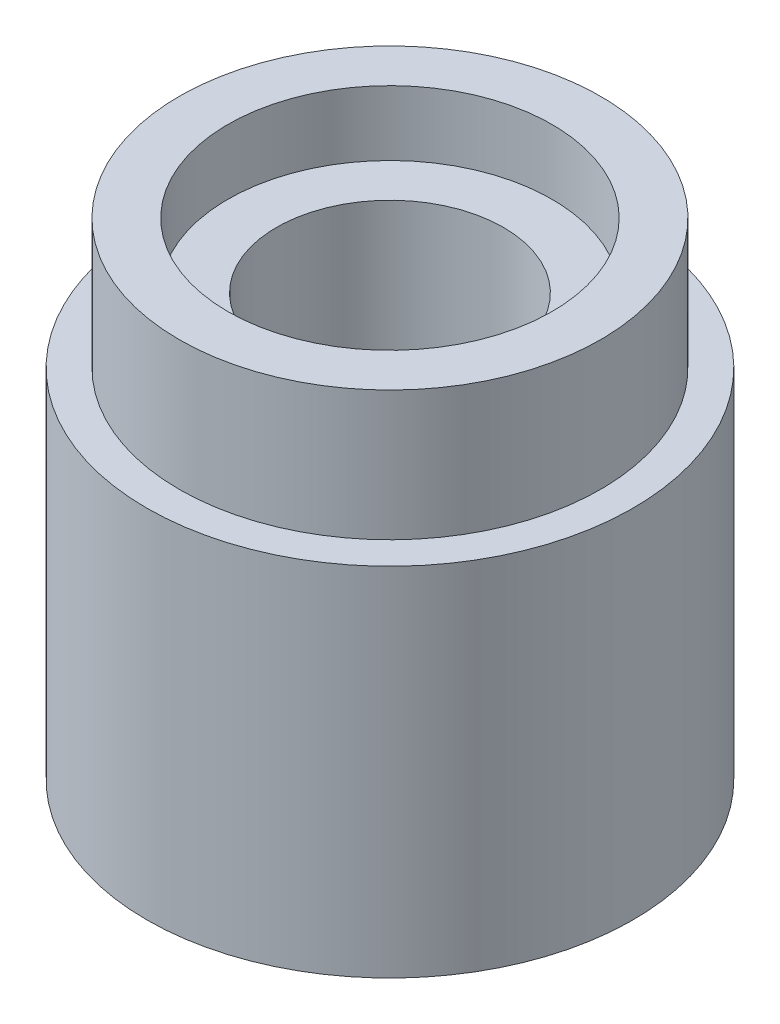
ISO-10303-21;
HEADER;
FILE_DESCRIPTION(('STEP AP214'),'2;1');
FILE_NAME('part.step','',(''),(''),'','','');
FILE_SCHEMA(('AUTOMOTIVE_DESIGN { 1 0 10303 214 1 1 1 1 }'));
ENDSEC;
DATA;
#1=APPLICATION_CONTEXT('core data for automotive mechanical design processes');
#2=APPLICATION_PROTOCOL_DEFINITION('international standard','automotive_design',2000,#1);
#3=PRODUCT_CONTEXT('',#1,'mechanical');
#4=PRODUCT('Part','Part','',(#3));
#5=PRODUCT_RELATED_PRODUCT_CATEGORY('part','',(#4));
#6=PRODUCT_DEFINITION_FORMATION('','',#4);
#7=PRODUCT_DEFINITION_CONTEXT('part definition',#1,'design');
#8=PRODUCT_DEFINITION('design','',#6,#7);
#9=PRODUCT_DEFINITION_SHAPE('','',#8);
#10=(LENGTH_UNIT() NAMED_UNIT(*) SI_UNIT(.MILLI.,.METRE.));
#11=(NAMED_UNIT(*) PLANE_ANGLE_UNIT() SI_UNIT($,.RADIAN.));
#12=(NAMED_UNIT(*) SI_UNIT($,.STERADIAN.) SOLID_ANGLE_UNIT());
#13=UNCERTAINTY_MEASURE_WITH_UNIT(LENGTH_MEASURE(1.E-05),#10,'distance_accuracy_value','');
#14=(GEOMETRIC_REPRESENTATION_CONTEXT(3) GLOBAL_UNCERTAINTY_ASSIGNED_CONTEXT((#13)) GLOBAL_UNIT_ASSIGNED_CONTEXT((#10,
#11,#12)) REPRESENTATION_CONTEXT('',''));
#15=CARTESIAN_POINT('',(0.,0.,0.));
#16=DIRECTION('',(0.,0.,1.));
#17=DIRECTION('',(1.,0.,0.));
#18=AXIS2_PLACEMENT_3D('',#15,#16,#17);
#19=CARTESIAN_POINT('',(0.,7.5,0.));
#20=DIRECTION('',(0.,-1.,0.));
#21=DIRECTION('',(0.,0.,-1.));
#22=AXIS2_PLACEMENT_3D('',#19,#20,#21);
#23=CYLINDRICAL_SURFACE('',#22,3.75);
#24=CARTESIAN_POINT('',(0.,0.,0.));
#25=DIRECTION('',(0.,1.,0.));
#26=DIRECTION('',(0.,0.,1.));
#27=AXIS2_PLACEMENT_3D('',#24,#25,#26);
#28=CIRCLE('',#27,3.75);
#29=CARTESIAN_POINT('',(0.,0.,3.75));
#30=VERTEX_POINT('',#29);
#31=EDGE_CURVE('E10',#30,#30,#28,.T.);
#32=ORIENTED_EDGE('',*,*,#31,.T.);
#33=EDGE_LOOP('',(#32));
#34=FACE_BOUND('',#33,.T.);
#35=CARTESIAN_POINT('',(0.,5.5,0.));
#36=DIRECTION('',(0.,1.,0.));
#37=DIRECTION('',(0.,0.,1.));
#38=AXIS2_PLACEMENT_3D('',#35,#36,#37);
#39=CIRCLE('',#38,3.75);
#40=CARTESIAN_POINT('',(0.,5.5,3.75));
#41=VERTEX_POINT('',#40);
#42=EDGE_CURVE('E44',#41,#41,#39,.T.);
#43=ORIENTED_EDGE('',*,*,#42,.F.);
#44=EDGE_LOOP('',(#43));
#45=FACE_BOUND('',#44,.T.);
#46=ADVANCED_FACE('F36',(#34,#45),#23,.T.);
#47=CARTESIAN_POINT('',(0.,0.,0.));
#48=DIRECTION('',(0.,1.,0.));
#49=DIRECTION('',(0.,0.,1.));
#50=AXIS2_PLACEMENT_3D('',#47,#48,#49);
#51=PLANE('',#50);
#52=ORIENTED_EDGE('',*,*,#31,.F.);
#53=EDGE_LOOP('',(#52));
#54=FACE_BOUND('',#53,.T.);
#55=ADVANCED_FACE('F92',(#54),#51,.F.);
#56=CARTESIAN_POINT('',(0.,5.5,0.));
#57=DIRECTION('',(0.,1.,0.));
#58=DIRECTION('',(0.,0.,1.));
#59=AXIS2_PLACEMENT_3D('',#56,#57,#58);
#60=PLANE('',#59);
#61=CARTESIAN_POINT('',(0.,5.5,0.));
#62=DIRECTION('',(0.,1.,0.));
#63=DIRECTION('',(0.,0.,1.));
#64=AXIS2_PLACEMENT_3D('',#61,#62,#63);
#65=CIRCLE('',#64,3.25);
#66=CARTESIAN_POINT('',(0.,5.5,3.25));
#67=VERTEX_POINT('',#66);
#68=EDGE_CURVE('E49',#67,#67,#65,.T.);
#69=ORIENTED_EDGE('',*,*,#68,.F.);
#70=EDGE_LOOP('',(#69));
#71=FACE_BOUND('',#70,.T.);
#72=ORIENTED_EDGE('',*,*,#42,.T.);
#73=EDGE_LOOP('',(#72));
#74=FACE_BOUND('',#73,.T.);
#75=ADVANCED_FACE('F98',(#71,#74),#60,.T.);
#76=CARTESIAN_POINT('',(0.,5.5,0.));
#77=DIRECTION('',(0.,1.,0.));
#78=DIRECTION('',(0.,0.,1.));
#79=AXIS2_PLACEMENT_3D('',#76,#77,#78);
#80=CYLINDRICAL_SURFACE('',#79,3.25);
#81=ORIENTED_EDGE('',*,*,#68,.T.);
#82=EDGE_LOOP('',(#81));
#83=FACE_BOUND('',#82,.T.);
#84=CARTESIAN_POINT('',(0.,7.5,0.));
#85=DIRECTION('',(0.,1.,0.));
#86=DIRECTION('',(0.,0.,1.));
#87=AXIS2_PLACEMENT_3D('',#84,#85,#86);
#88=CIRCLE('',#87,3.25);
#89=CARTESIAN_POINT('',(0.,7.5,3.25));
#90=VERTEX_POINT('',#89);
#91=EDGE_CURVE('E52',#90,#90,#88,.T.);
#92=ORIENTED_EDGE('',*,*,#91,.F.);
#93=EDGE_LOOP('',(#92));
#94=FACE_BOUND('',#93,.T.);
#95=ADVANCED_FACE('F104',(#83,#94),#80,.T.);
#96=CARTESIAN_POINT('',(0.,7.5,0.));
#97=DIRECTION('',(0.,1.,0.));
#98=DIRECTION('',(0.,0.,1.));
#99=AXIS2_PLACEMENT_3D('',#96,#97,#98);
#100=PLANE('',#99);
#101=CARTESIAN_POINT('',(0.,7.5,0.));
#102=DIRECTION('',(0.,1.,0.));
#103=DIRECTION('',(0.,0.,1.));
#104=AXIS2_PLACEMENT_3D('',#101,#102,#103);
#105=CIRCLE('',#104,2.5);
#106=CARTESIAN_POINT('',(0.,7.5,2.5));
#107=VERTEX_POINT('',#106);
#108=EDGE_CURVE('E63',#107,#107,#105,.T.);
#109=ORIENTED_EDGE('',*,*,#108,.F.);
#110=EDGE_LOOP('',(#109));
#111=FACE_BOUND('',#110,.T.);
#112=ORIENTED_EDGE('',*,*,#91,.T.);
#113=EDGE_LOOP('',(#112));
#114=FACE_BOUND('',#113,.T.);
#115=ADVANCED_FACE('F110',(#111,#114),#100,.T.);
#116=CARTESIAN_POINT('',(0.,6.5,0.));
#117=DIRECTION('',(0.,1.,0.));
#118=DIRECTION('',(0.,0.,1.));
#119=AXIS2_PLACEMENT_3D('',#116,#117,#118);
#120=PLANE('',#119);
#121=CARTESIAN_POINT('',(0.,6.5,0.));
#122=DIRECTION('',(0.,1.,0.));
#123=DIRECTION('',(0.,0.,1.));
#124=AXIS2_PLACEMENT_3D('',#121,#122,#123);
#125=CIRCLE('',#124,2.5);
#126=CARTESIAN_POINT('',(0.,6.5,2.5));
#127=VERTEX_POINT('',#126);
#128=EDGE_CURVE('E67',#127,#127,#125,.T.);
#129=ORIENTED_EDGE('',*,*,#128,.T.);
#130=EDGE_LOOP('',(#129));
#131=FACE_BOUND('',#130,.T.);
#132=CARTESIAN_POINT('',(0.,6.5,0.));
#133=DIRECTION('',(0.,1.,0.));
#134=DIRECTION('',(0.,0.,1.));
#135=AXIS2_PLACEMENT_3D('',#132,#133,#134);
#136=CIRCLE('',#135,1.75);
#137=CARTESIAN_POINT('',(0.,6.5,1.75));
#138=VERTEX_POINT('',#137);
#139=EDGE_CURVE('E39',#138,#138,#136,.F.);
#140=ORIENTED_EDGE('',*,*,#139,.T.);
#141=EDGE_LOOP('',(#140));
#142=FACE_BOUND('',#141,.T.);
#143=ADVANCED_FACE('F76',(#131,#142),#120,.T.);
#144=CARTESIAN_POINT('',(0.,6.5,0.));
#145=DIRECTION('',(0.,1.,0.));
#146=DIRECTION('',(0.,0.,1.));
#147=AXIS2_PLACEMENT_3D('',#144,#145,#146);
#148=CYLINDRICAL_SURFACE('',#147,2.5);
#149=ORIENTED_EDGE('',*,*,#128,.F.);
#150=EDGE_LOOP('',(#149));
#151=FACE_BOUND('',#150,.T.);
#152=ORIENTED_EDGE('',*,*,#108,.T.);
#153=EDGE_LOOP('',(#152));
#154=FACE_BOUND('',#153,.T.);
#155=ADVANCED_FACE('F86',(#151,#154),#148,.F.);
#156=CARTESIAN_POINT('',(0.,0.5,0.));
#157=DIRECTION('',(0.,1.,0.));
#158=DIRECTION('',(0.,0.,1.));
#159=AXIS2_PLACEMENT_3D('',#156,#157,#158);
#160=PLANE('',#159);
#161=CARTESIAN_POINT('',(0.,0.5,0.));
#162=DIRECTION('',(0.,1.,0.));
#163=DIRECTION('',(0.,0.,1.));
#164=AXIS2_PLACEMENT_3D('',#161,#162,#163);
#165=CIRCLE('',#164,1.75);
#166=CARTESIAN_POINT('',(0.,0.5,1.75));
#167=VERTEX_POINT('',#166);
#168=EDGE_CURVE('E56',#167,#167,#165,.T.);
#169=ORIENTED_EDGE('',*,*,#168,.T.);
#170=EDGE_LOOP('',(#169));
#171=FACE_BOUND('',#170,.T.);
#172=ADVANCED_FACE('F80',(#171),#160,.T.);
#173=CARTESIAN_POINT('',(0.,0.5,0.));
#174=DIRECTION('',(0.,1.,0.));
#175=DIRECTION('',(0.,0.,1.));
#176=AXIS2_PLACEMENT_3D('',#173,#174,#175);
#177=CYLINDRICAL_SURFACE('',#176,1.75);
#178=ORIENTED_EDGE('',*,*,#168,.F.);
#179=EDGE_LOOP('',(#178));
#180=FACE_BOUND('',#179,.T.);
#181=ORIENTED_EDGE('',*,*,#139,.F.);
#182=EDGE_LOOP('',(#181));
#183=FACE_BOUND('',#182,.T.);
#184=ADVANCED_FACE('F78',(#180,#183),#177,.F.);
#185=CLOSED_SHELL('',(#46,#55,#75,#95,#115,#143,#155,#172,#184));
#186=MANIFOLD_SOLID_BREP('B2',#185);
#187=ADVANCED_BREP_SHAPE_REPRESENTATION('',(#18,#186),#14);
#188=SHAPE_DEFINITION_REPRESENTATION(#9,#187);
ENDSEC;
END-ISO-10303-21;
